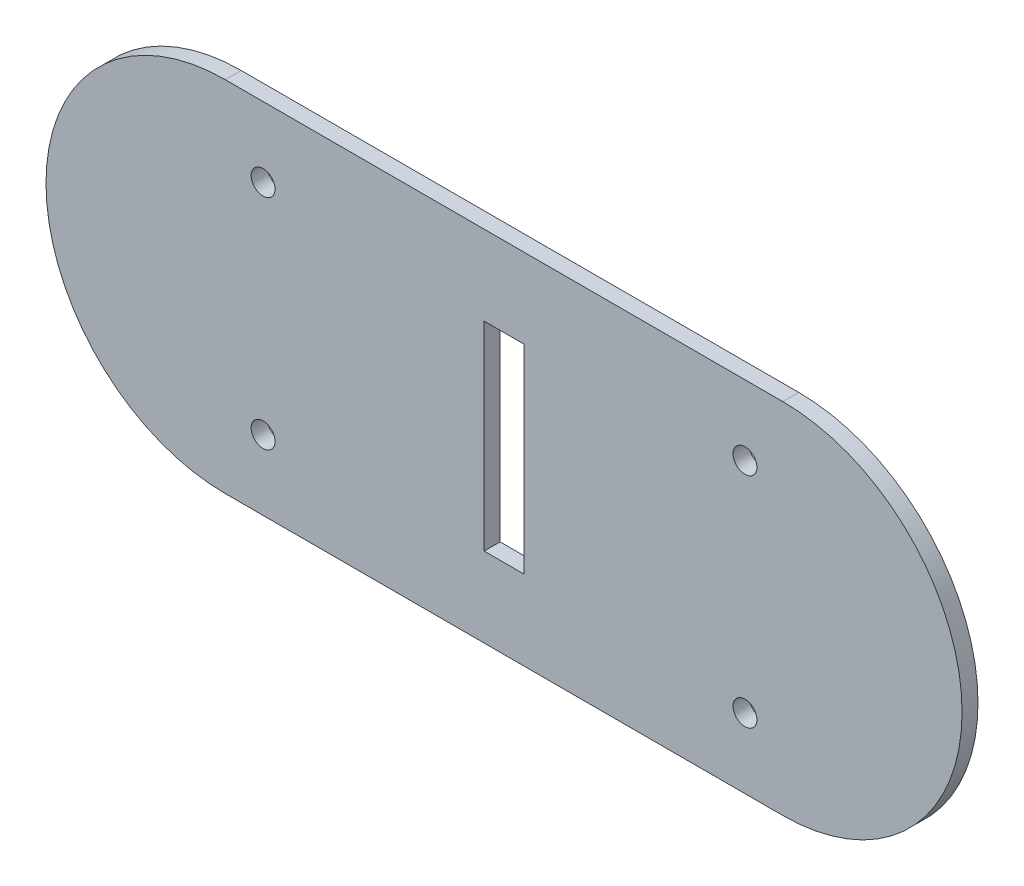
ISO-10303-21;
HEADER;
FILE_DESCRIPTION(('STEP AP214'),'2;1');
FILE_NAME('part.step','',(''),(''),'','','');
FILE_SCHEMA(('AUTOMOTIVE_DESIGN { 1 0 10303 214 1 1 1 1 }'));
ENDSEC;
DATA;
#1=APPLICATION_CONTEXT('core data for automotive mechanical design processes');
#2=APPLICATION_PROTOCOL_DEFINITION('international standard','automotive_design',2000,#1);
#3=PRODUCT_CONTEXT('',#1,'mechanical');
#4=PRODUCT('Part','Part','',(#3));
#5=PRODUCT_RELATED_PRODUCT_CATEGORY('part','',(#4));
#6=PRODUCT_DEFINITION_FORMATION('','',#4);
#7=PRODUCT_DEFINITION_CONTEXT('part definition',#1,'design');
#8=PRODUCT_DEFINITION('design','',#6,#7);
#9=PRODUCT_DEFINITION_SHAPE('','',#8);
#10=(LENGTH_UNIT() NAMED_UNIT(*) SI_UNIT(.MILLI.,.METRE.));
#11=(NAMED_UNIT(*) PLANE_ANGLE_UNIT() SI_UNIT($,.RADIAN.));
#12=(NAMED_UNIT(*) SI_UNIT($,.STERADIAN.) SOLID_ANGLE_UNIT());
#13=UNCERTAINTY_MEASURE_WITH_UNIT(LENGTH_MEASURE(1.E-05),#10,'distance_accuracy_value','');
#14=(GEOMETRIC_REPRESENTATION_CONTEXT(3) GLOBAL_UNCERTAINTY_ASSIGNED_CONTEXT((#13)) GLOBAL_UNIT_ASSIGNED_CONTEXT((#10,
#11,#12)) REPRESENTATION_CONTEXT('',''));
#15=CARTESIAN_POINT('',(0.,0.,0.));
#16=DIRECTION('',(0.,0.,1.));
#17=DIRECTION('',(1.,0.,0.));
#18=AXIS2_PLACEMENT_3D('',#15,#16,#17);
#19=CARTESIAN_POINT('',(90.1646015852963,212.057553234732,-190.475370577193));
#20=DIRECTION('',(0.,0.,1.));
#21=DIRECTION('',(-1.,0.,0.));
#22=AXIS2_PLACEMENT_3D('',#19,#20,#21);
#23=CYLINDRICAL_SURFACE('',#22,22.5);
#24=CARTESIAN_POINT('',(90.1646015852963,212.057553234732,-188.475370577193));
#25=DIRECTION('',(0.,0.,1.));
#26=DIRECTION('',(1.,0.,0.));
#27=AXIS2_PLACEMENT_3D('',#24,#25,#26);
#28=CIRCLE('',#27,22.5);
#29=CARTESIAN_POINT('',(90.1646015852963,189.557553234732,-188.475370577193));
#30=VERTEX_POINT('',#29);
#31=CARTESIAN_POINT('',(90.1646015852963,234.557553234732,-188.475370577193));
#32=VERTEX_POINT('',#31);
#33=EDGE_CURVE('E150',#30,#32,#28,.T.);
#34=ORIENTED_EDGE('',*,*,#33,.F.);
#35=DIRECTION('',(0.,0.,1.));
#36=VECTOR('',#35,1.);
#37=CARTESIAN_POINT('',(90.1646015852963,189.557553234732,-190.475370577193));
#38=LINE('',#37,#36);
#39=CARTESIAN_POINT('',(90.1646015852963,189.557553234732,-190.475370577193));
#40=VERTEX_POINT('',#39);
#41=EDGE_CURVE('E165',#40,#30,#38,.T.);
#42=ORIENTED_EDGE('',*,*,#41,.F.);
#43=CARTESIAN_POINT('',(90.1646015852963,212.057553234732,-190.475370577193));
#44=DIRECTION('',(0.,0.,1.));
#45=DIRECTION('',(1.,0.,0.));
#46=AXIS2_PLACEMENT_3D('',#43,#44,#45);
#47=CIRCLE('',#46,22.5);
#48=CARTESIAN_POINT('',(90.1646015852963,234.557553234732,-190.475370577193));
#49=VERTEX_POINT('',#48);
#50=EDGE_CURVE('E153',#40,#49,#47,.T.);
#51=ORIENTED_EDGE('',*,*,#50,.T.);
#52=DIRECTION('',(0.,0.,1.));
#53=VECTOR('',#52,1.);
#54=CARTESIAN_POINT('',(90.1646015852963,234.557553234732,-190.475370577193));
#55=LINE('',#54,#53);
#56=EDGE_CURVE('E183',#49,#32,#55,.T.);
#57=ORIENTED_EDGE('',*,*,#56,.T.);
#58=EDGE_LOOP('',(#34,#42,#51,#57));
#59=FACE_BOUND('',#58,.T.);
#60=ADVANCED_FACE('F37',(#59),#23,.T.);
#61=CARTESIAN_POINT('',(90.1646015852963,234.557553234732,-190.475370577193));
#62=DIRECTION('',(0.,-1.,0.));
#63=DIRECTION('',(0.,0.,1.));
#64=AXIS2_PLACEMENT_3D('',#61,#62,#63);
#65=PLANE('',#64);
#66=DIRECTION('',(-1.,0.,0.));
#67=VECTOR('',#66,1.);
#68=CARTESIAN_POINT('',(90.1646015852963,234.557553234732,-188.475370577193));
#69=LINE('',#68,#67);
#70=CARTESIAN_POINT('',(20.1646015852963,234.557553234732,-188.475370577193));
#71=VERTEX_POINT('',#70);
#72=EDGE_CURVE('E168',#32,#71,#69,.T.);
#73=ORIENTED_EDGE('',*,*,#72,.F.);
#74=ORIENTED_EDGE('',*,*,#56,.F.);
#75=DIRECTION('',(-1.,0.,0.));
#76=VECTOR('',#75,1.);
#77=CARTESIAN_POINT('',(90.1646015852963,234.557553234732,-190.475370577193));
#78=LINE('',#77,#76);
#79=CARTESIAN_POINT('',(20.1646015852963,234.557553234732,-190.475370577193));
#80=VERTEX_POINT('',#79);
#81=EDGE_CURVE('E156',#49,#80,#78,.T.);
#82=ORIENTED_EDGE('',*,*,#81,.T.);
#83=DIRECTION('',(0.,0.,1.));
#84=VECTOR('',#83,1.);
#85=CARTESIAN_POINT('',(20.1646015852963,234.557553234732,-190.475370577193));
#86=LINE('',#85,#84);
#87=EDGE_CURVE('E180',#80,#71,#86,.T.);
#88=ORIENTED_EDGE('',*,*,#87,.T.);
#89=EDGE_LOOP('',(#73,#74,#82,#88));
#90=FACE_BOUND('',#89,.T.);
#91=ADVANCED_FACE('F211',(#90),#65,.F.);
#92=CARTESIAN_POINT('',(20.1646015852963,212.057553234732,-190.475370577193));
#93=DIRECTION('',(0.,0.,1.));
#94=DIRECTION('',(-1.,0.,0.));
#95=AXIS2_PLACEMENT_3D('',#92,#93,#94);
#96=CYLINDRICAL_SURFACE('',#95,22.5);
#97=CARTESIAN_POINT('',(20.1646015852963,212.057553234732,-188.475370577193));
#98=DIRECTION('',(0.,0.,1.));
#99=DIRECTION('',(1.,0.,0.));
#100=AXIS2_PLACEMENT_3D('',#97,#98,#99);
#101=CIRCLE('',#100,22.5);
#102=CARTESIAN_POINT('',(20.1646015852963,189.557553234732,-188.475370577193));
#103=VERTEX_POINT('',#102);
#104=EDGE_CURVE('E171',#71,#103,#101,.T.);
#105=ORIENTED_EDGE('',*,*,#104,.F.);
#106=ORIENTED_EDGE('',*,*,#87,.F.);
#107=CARTESIAN_POINT('',(20.1646015852963,212.057553234732,-190.475370577193));
#108=DIRECTION('',(0.,0.,1.));
#109=DIRECTION('',(1.,0.,0.));
#110=AXIS2_PLACEMENT_3D('',#107,#108,#109);
#111=CIRCLE('',#110,22.5);
#112=CARTESIAN_POINT('',(20.1646015852963,189.557553234732,-190.475370577193));
#113=VERTEX_POINT('',#112);
#114=EDGE_CURVE('E160',#80,#113,#111,.T.);
#115=ORIENTED_EDGE('',*,*,#114,.T.);
#116=DIRECTION('',(0.,0.,1.));
#117=VECTOR('',#116,1.);
#118=CARTESIAN_POINT('',(20.1646015852963,189.557553234732,-190.475370577193));
#119=LINE('',#118,#117);
#120=EDGE_CURVE('E177',#113,#103,#119,.T.);
#121=ORIENTED_EDGE('',*,*,#120,.T.);
#122=EDGE_LOOP('',(#105,#106,#115,#121));
#123=FACE_BOUND('',#122,.T.);
#124=ADVANCED_FACE('F216',(#123),#96,.T.);
#125=CARTESIAN_POINT('',(90.1646015852963,189.557553234732,-190.475370577193));
#126=DIRECTION('',(0.,1.,0.));
#127=DIRECTION('',(0.,0.,-1.));
#128=AXIS2_PLACEMENT_3D('',#125,#126,#127);
#129=PLANE('',#128);
#130=DIRECTION('',(1.,0.,0.));
#131=VECTOR('',#130,1.);
#132=CARTESIAN_POINT('',(90.1646015852963,189.557553234732,-188.475370577193));
#133=LINE('',#132,#131);
#134=EDGE_CURVE('E157',#103,#30,#133,.T.);
#135=ORIENTED_EDGE('',*,*,#134,.F.);
#136=ORIENTED_EDGE('',*,*,#120,.F.);
#137=DIRECTION('',(1.,0.,0.));
#138=VECTOR('',#137,1.);
#139=CARTESIAN_POINT('',(90.1646015852963,189.557553234732,-190.475370577193));
#140=LINE('',#139,#138);
#141=EDGE_CURVE('E163',#113,#40,#140,.T.);
#142=ORIENTED_EDGE('',*,*,#141,.T.);
#143=ORIENTED_EDGE('',*,*,#41,.T.);
#144=EDGE_LOOP('',(#135,#136,#142,#143));
#145=FACE_BOUND('',#144,.T.);
#146=ADVANCED_FACE('F224',(#145),#129,.F.);
#147=CARTESIAN_POINT('',(90.1646015852963,212.057553234732,-190.475370577193));
#148=DIRECTION('',(0.,0.,-1.));
#149=DIRECTION('',(1.,0.,0.));
#150=AXIS2_PLACEMENT_3D('',#147,#148,#149);
#151=PLANE('',#150);
#152=DIRECTION('',(0.,-1.,0.));
#153=VECTOR('',#152,1.);
#154=CARTESIAN_POINT('',(52.6646015852963,224.557553234732,-190.475370577193));
#155=LINE('',#154,#153);
#156=CARTESIAN_POINT('',(52.6646015852963,224.557553234732,-190.475370577193));
#157=VERTEX_POINT('',#156);
#158=CARTESIAN_POINT('',(52.6646015852963,199.557553234732,-190.475370577193));
#159=VERTEX_POINT('',#158);
#160=EDGE_CURVE('E119',#157,#159,#155,.T.);
#161=ORIENTED_EDGE('',*,*,#160,.T.);
#162=DIRECTION('',(1.,0.,0.));
#163=VECTOR('',#162,1.);
#164=CARTESIAN_POINT('',(52.6646015852963,199.557553234732,-190.475370577193));
#165=LINE('',#164,#163);
#166=CARTESIAN_POINT('',(57.6646015852963,199.557553234732,-190.475370577193));
#167=VERTEX_POINT('',#166);
#168=EDGE_CURVE('E102',#159,#167,#165,.T.);
#169=ORIENTED_EDGE('',*,*,#168,.T.);
#170=DIRECTION('',(0.,1.,0.));
#171=VECTOR('',#170,1.);
#172=CARTESIAN_POINT('',(57.6646015852963,224.557553234732,-190.475370577193));
#173=LINE('',#172,#171);
#174=CARTESIAN_POINT('',(57.6646015852963,224.557553234732,-190.475370577193));
#175=VERTEX_POINT('',#174);
#176=EDGE_CURVE('E110',#167,#175,#173,.T.);
#177=ORIENTED_EDGE('',*,*,#176,.T.);
#178=DIRECTION('',(-1.,0.,0.));
#179=VECTOR('',#178,1.);
#180=CARTESIAN_POINT('',(52.6646015852963,224.557553234732,-190.475370577193));
#181=LINE('',#180,#179);
#182=EDGE_CURVE('E115',#175,#157,#181,.T.);
#183=ORIENTED_EDGE('',*,*,#182,.T.);
#184=EDGE_LOOP('',(#161,#169,#177,#183));
#185=FACE_BOUND('',#184,.T.);
#186=CARTESIAN_POINT('',(85.4115481479809,198.337800112773,-190.475370577193));
#187=DIRECTION('',(0.,0.,1.));
#188=DIRECTION('',(-1.,0.,0.));
#189=AXIS2_PLACEMENT_3D('',#186,#187,#188);
#190=CIRCLE('',#189,1.5);
#191=CARTESIAN_POINT('',(83.9115481479809,198.337800112773,-190.475370577193));
#192=VERTEX_POINT('',#191);
#193=EDGE_CURVE('E126',#192,#192,#190,.T.);
#194=ORIENTED_EDGE('',*,*,#193,.T.);
#195=EDGE_LOOP('',(#194));
#196=FACE_BOUND('',#195,.T.);
#197=CARTESIAN_POINT('',(24.9176550226118,198.337800112773,-190.475370577193));
#198=DIRECTION('',(0.,0.,1.));
#199=DIRECTION('',(1.,0.,0.));
#200=AXIS2_PLACEMENT_3D('',#197,#198,#199);
#201=CIRCLE('',#200,1.5);
#202=CARTESIAN_POINT('',(26.4176550226118,198.337800112773,-190.475370577193));
#203=VERTEX_POINT('',#202);
#204=EDGE_CURVE('E139',#203,#203,#201,.T.);
#205=ORIENTED_EDGE('',*,*,#204,.T.);
#206=EDGE_LOOP('',(#205));
#207=FACE_BOUND('',#206,.T.);
#208=CARTESIAN_POINT('',(24.9176550226117,225.77730635669,-190.475370577193));
#209=DIRECTION('',(0.,0.,1.));
#210=DIRECTION('',(-1.,0.,0.));
#211=AXIS2_PLACEMENT_3D('',#208,#209,#210);
#212=CIRCLE('',#211,1.5);
#213=CARTESIAN_POINT('',(23.4176550226117,225.77730635669,-190.475370577193));
#214=VERTEX_POINT('',#213);
#215=EDGE_CURVE('E133',#214,#214,#212,.T.);
#216=ORIENTED_EDGE('',*,*,#215,.T.);
#217=EDGE_LOOP('',(#216));
#218=FACE_BOUND('',#217,.T.);
#219=CARTESIAN_POINT('',(85.4115481479809,225.77730635669,-190.475370577193));
#220=DIRECTION('',(0.,0.,1.));
#221=DIRECTION('',(1.,0.,0.));
#222=AXIS2_PLACEMENT_3D('',#219,#220,#221);
#223=CIRCLE('',#222,1.5);
#224=CARTESIAN_POINT('',(86.9115481479809,225.77730635669,-190.475370577193));
#225=VERTEX_POINT('',#224);
#226=EDGE_CURVE('E132',#225,#225,#223,.T.);
#227=ORIENTED_EDGE('',*,*,#226,.T.);
#228=EDGE_LOOP('',(#227));
#229=FACE_BOUND('',#228,.T.);
#230=ORIENTED_EDGE('',*,*,#50,.F.);
#231=ORIENTED_EDGE('',*,*,#141,.F.);
#232=ORIENTED_EDGE('',*,*,#114,.F.);
#233=ORIENTED_EDGE('',*,*,#81,.F.);
#234=EDGE_LOOP('',(#230,#231,#232,#233));
#235=FACE_BOUND('',#234,.T.);
#236=ADVANCED_FACE('F117',(#185,#196,#207,#218,#229,#235),#151,.T.);
#237=CARTESIAN_POINT('',(90.1646015852963,212.057553234732,-188.475370577193));
#238=DIRECTION('',(0.,0.,-1.));
#239=DIRECTION('',(1.,0.,0.));
#240=AXIS2_PLACEMENT_3D('',#237,#238,#239);
#241=PLANE('',#240);
#242=DIRECTION('',(-1.,0.,0.));
#243=VECTOR('',#242,1.);
#244=CARTESIAN_POINT('',(90.1646015852963,224.557553234732,-188.475370577193));
#245=LINE('',#244,#243);
#246=CARTESIAN_POINT('',(57.6646015852963,224.557553234732,-188.475370577193));
#247=VERTEX_POINT('',#246);
#248=CARTESIAN_POINT('',(52.6646015852963,224.557553234732,-188.475370577193));
#249=VERTEX_POINT('',#248);
#250=EDGE_CURVE('E44',#247,#249,#245,.T.);
#251=ORIENTED_EDGE('',*,*,#250,.F.);
#252=DIRECTION('',(0.,1.,0.));
#253=VECTOR('',#252,1.);
#254=CARTESIAN_POINT('',(57.6646015852963,212.057553234732,-188.475370577193));
#255=LINE('',#254,#253);
#256=CARTESIAN_POINT('',(57.6646015852963,199.557553234732,-188.475370577193));
#257=VERTEX_POINT('',#256);
#258=EDGE_CURVE('E187',#257,#247,#255,.T.);
#259=ORIENTED_EDGE('',*,*,#258,.F.);
#260=DIRECTION('',(1.,0.,0.));
#261=VECTOR('',#260,1.);
#262=CARTESIAN_POINT('',(90.1646015852963,199.557553234732,-188.475370577193));
#263=LINE('',#262,#261);
#264=CARTESIAN_POINT('',(52.6646015852963,199.557553234732,-188.475370577193));
#265=VERTEX_POINT('',#264);
#266=EDGE_CURVE('E105',#265,#257,#263,.T.);
#267=ORIENTED_EDGE('',*,*,#266,.F.);
#268=DIRECTION('',(0.,-1.,0.));
#269=VECTOR('',#268,1.);
#270=CARTESIAN_POINT('',(52.6646015852963,212.057553234732,-188.475370577193));
#271=LINE('',#270,#269);
#272=EDGE_CURVE('E11',#249,#265,#271,.T.);
#273=ORIENTED_EDGE('',*,*,#272,.F.);
#274=EDGE_LOOP('',(#251,#259,#267,#273));
#275=FACE_BOUND('',#274,.T.);
#276=CARTESIAN_POINT('',(85.4115481479809,198.337800112773,-188.475370577193));
#277=DIRECTION('',(0.,0.,1.));
#278=DIRECTION('',(-1.,0.,0.));
#279=AXIS2_PLACEMENT_3D('',#276,#277,#278);
#280=CIRCLE('',#279,1.5);
#281=CARTESIAN_POINT('',(83.9115481479809,198.337800112773,-188.475370577193));
#282=VERTEX_POINT('',#281);
#283=EDGE_CURVE('E142',#282,#282,#280,.T.);
#284=ORIENTED_EDGE('',*,*,#283,.F.);
#285=EDGE_LOOP('',(#284));
#286=FACE_BOUND('',#285,.T.);
#287=CARTESIAN_POINT('',(24.9176550226118,198.337800112773,-188.475370577193));
#288=DIRECTION('',(0.,0.,1.));
#289=DIRECTION('',(1.,0.,0.));
#290=AXIS2_PLACEMENT_3D('',#287,#288,#289);
#291=CIRCLE('',#290,1.5);
#292=CARTESIAN_POINT('',(26.4176550226118,198.337800112773,-188.475370577193));
#293=VERTEX_POINT('',#292);
#294=EDGE_CURVE('E136',#293,#293,#291,.T.);
#295=ORIENTED_EDGE('',*,*,#294,.F.);
#296=EDGE_LOOP('',(#295));
#297=FACE_BOUND('',#296,.T.);
#298=CARTESIAN_POINT('',(24.9176550226117,225.77730635669,-188.475370577193));
#299=DIRECTION('',(0.,0.,1.));
#300=DIRECTION('',(-1.,0.,0.));
#301=AXIS2_PLACEMENT_3D('',#298,#299,#300);
#302=CIRCLE('',#301,1.5);
#303=CARTESIAN_POINT('',(23.4176550226117,225.77730635669,-188.475370577193));
#304=VERTEX_POINT('',#303);
#305=EDGE_CURVE('E129',#304,#304,#302,.T.);
#306=ORIENTED_EDGE('',*,*,#305,.F.);
#307=EDGE_LOOP('',(#306));
#308=FACE_BOUND('',#307,.T.);
#309=CARTESIAN_POINT('',(85.4115481479809,225.77730635669,-188.475370577193));
#310=DIRECTION('',(0.,0.,1.));
#311=DIRECTION('',(1.,0.,0.));
#312=AXIS2_PLACEMENT_3D('',#309,#310,#311);
#313=CIRCLE('',#312,1.5);
#314=CARTESIAN_POINT('',(86.9115481479809,225.77730635669,-188.475370577193));
#315=VERTEX_POINT('',#314);
#316=EDGE_CURVE('E147',#315,#315,#313,.T.);
#317=ORIENTED_EDGE('',*,*,#316,.F.);
#318=EDGE_LOOP('',(#317));
#319=FACE_BOUND('',#318,.T.);
#320=ORIENTED_EDGE('',*,*,#33,.T.);
#321=ORIENTED_EDGE('',*,*,#72,.T.);
#322=ORIENTED_EDGE('',*,*,#104,.T.);
#323=ORIENTED_EDGE('',*,*,#134,.T.);
#324=EDGE_LOOP('',(#320,#321,#322,#323));
#325=FACE_BOUND('',#324,.T.);
#326=ADVANCED_FACE('F194',(#275,#286,#297,#308,#319,#325),#241,.F.);
#327=CARTESIAN_POINT('',(85.4115481479809,225.77730635669,-188.475370577193));
#328=DIRECTION('',(0.,0.,-1.));
#329=DIRECTION('',(1.,0.,0.));
#330=AXIS2_PLACEMENT_3D('',#327,#328,#329);
#331=CYLINDRICAL_SURFACE('',#330,1.5);
#332=ORIENTED_EDGE('',*,*,#316,.T.);
#333=EDGE_LOOP('',(#332));
#334=FACE_BOUND('',#333,.T.);
#335=ORIENTED_EDGE('',*,*,#226,.F.);
#336=EDGE_LOOP('',(#335));
#337=FACE_BOUND('',#336,.T.);
#338=ADVANCED_FACE('F238',(#334,#337),#331,.F.);
#339=CARTESIAN_POINT('',(24.9176550226117,225.77730635669,-188.475370577193));
#340=DIRECTION('',(0.,0.,-1.));
#341=DIRECTION('',(1.,0.,0.));
#342=AXIS2_PLACEMENT_3D('',#339,#340,#341);
#343=CYLINDRICAL_SURFACE('',#342,1.5);
#344=ORIENTED_EDGE('',*,*,#305,.T.);
#345=EDGE_LOOP('',(#344));
#346=FACE_BOUND('',#345,.T.);
#347=ORIENTED_EDGE('',*,*,#215,.F.);
#348=EDGE_LOOP('',(#347));
#349=FACE_BOUND('',#348,.T.);
#350=ADVANCED_FACE('F242',(#346,#349),#343,.F.);
#351=CARTESIAN_POINT('',(24.9176550226118,198.337800112773,-188.475370577193));
#352=DIRECTION('',(0.,0.,-1.));
#353=DIRECTION('',(1.,0.,0.));
#354=AXIS2_PLACEMENT_3D('',#351,#352,#353);
#355=CYLINDRICAL_SURFACE('',#354,1.5);
#356=ORIENTED_EDGE('',*,*,#294,.T.);
#357=EDGE_LOOP('',(#356));
#358=FACE_BOUND('',#357,.T.);
#359=ORIENTED_EDGE('',*,*,#204,.F.);
#360=EDGE_LOOP('',(#359));
#361=FACE_BOUND('',#360,.T.);
#362=ADVANCED_FACE('F205',(#358,#361),#355,.F.);
#363=CARTESIAN_POINT('',(85.4115481479809,198.337800112773,-188.475370577193));
#364=DIRECTION('',(0.,0.,-1.));
#365=DIRECTION('',(1.,0.,0.));
#366=AXIS2_PLACEMENT_3D('',#363,#364,#365);
#367=CYLINDRICAL_SURFACE('',#366,1.5);
#368=ORIENTED_EDGE('',*,*,#283,.T.);
#369=EDGE_LOOP('',(#368));
#370=FACE_BOUND('',#369,.T.);
#371=ORIENTED_EDGE('',*,*,#193,.F.);
#372=EDGE_LOOP('',(#371));
#373=FACE_BOUND('',#372,.T.);
#374=ADVANCED_FACE('F198',(#370,#373),#367,.F.);
#375=CARTESIAN_POINT('',(52.6646015852963,224.557553234732,-180.475370577193));
#376=DIRECTION('',(-1.,0.,0.));
#377=DIRECTION('',(0.,0.,-1.));
#378=AXIS2_PLACEMENT_3D('',#375,#376,#377);
#379=PLANE('',#378);
#380=DIRECTION('',(0.,0.,-1.));
#381=VECTOR('',#380,1.);
#382=CARTESIAN_POINT('',(52.6646015852963,224.557553234732,-180.475370577193));
#383=LINE('',#382,#381);
#384=EDGE_CURVE('E124',#249,#157,#383,.T.);
#385=ORIENTED_EDGE('',*,*,#384,.F.);
#386=ORIENTED_EDGE('',*,*,#272,.T.);
#387=DIRECTION('',(0.,0.,-1.));
#388=VECTOR('',#387,1.);
#389=CARTESIAN_POINT('',(52.6646015852963,199.557553234732,-180.475370577193));
#390=LINE('',#389,#388);
#391=EDGE_CURVE('E50',#265,#159,#390,.T.);
#392=ORIENTED_EDGE('',*,*,#391,.T.);
#393=ORIENTED_EDGE('',*,*,#160,.F.);
#394=EDGE_LOOP('',(#385,#386,#392,#393));
#395=FACE_BOUND('',#394,.T.);
#396=ADVANCED_FACE('F196',(#395),#379,.F.);
#397=CARTESIAN_POINT('',(52.6646015852963,224.557553234732,-180.475370577193));
#398=DIRECTION('',(0.,1.,0.));
#399=DIRECTION('',(0.,0.,-1.));
#400=AXIS2_PLACEMENT_3D('',#397,#398,#399);
#401=PLANE('',#400);
#402=DIRECTION('',(0.,0.,-1.));
#403=VECTOR('',#402,1.);
#404=CARTESIAN_POINT('',(57.6646015852963,224.557553234732,-180.475370577193));
#405=LINE('',#404,#403);
#406=EDGE_CURVE('E107',#247,#175,#405,.T.);
#407=ORIENTED_EDGE('',*,*,#406,.F.);
#408=ORIENTED_EDGE('',*,*,#250,.T.);
#409=ORIENTED_EDGE('',*,*,#384,.T.);
#410=ORIENTED_EDGE('',*,*,#182,.F.);
#411=EDGE_LOOP('',(#407,#408,#409,#410));
#412=FACE_BOUND('',#411,.T.);
#413=ADVANCED_FACE('F191',(#412),#401,.F.);
#414=CARTESIAN_POINT('',(57.6646015852963,224.557553234732,-180.475370577193));
#415=DIRECTION('',(1.,0.,0.));
#416=DIRECTION('',(0.,1.,0.));
#417=AXIS2_PLACEMENT_3D('',#414,#415,#416);
#418=PLANE('',#417);
#419=DIRECTION('',(0.,0.,-1.));
#420=VECTOR('',#419,1.);
#421=CARTESIAN_POINT('',(57.6646015852963,199.557553234732,-180.475370577193));
#422=LINE('',#421,#420);
#423=EDGE_CURVE('E58',#257,#167,#422,.T.);
#424=ORIENTED_EDGE('',*,*,#423,.F.);
#425=ORIENTED_EDGE('',*,*,#258,.T.);
#426=ORIENTED_EDGE('',*,*,#406,.T.);
#427=ORIENTED_EDGE('',*,*,#176,.F.);
#428=EDGE_LOOP('',(#424,#425,#426,#427));
#429=FACE_BOUND('',#428,.T.);
#430=ADVANCED_FACE('F111',(#429),#418,.F.);
#431=CARTESIAN_POINT('',(52.6646015852963,199.557553234732,-180.475370577193));
#432=DIRECTION('',(0.,-1.,0.));
#433=DIRECTION('',(0.,0.,1.));
#434=AXIS2_PLACEMENT_3D('',#431,#432,#433);
#435=PLANE('',#434);
#436=ORIENTED_EDGE('',*,*,#391,.F.);
#437=ORIENTED_EDGE('',*,*,#266,.T.);
#438=ORIENTED_EDGE('',*,*,#423,.T.);
#439=ORIENTED_EDGE('',*,*,#168,.F.);
#440=EDGE_LOOP('',(#436,#437,#438,#439));
#441=FACE_BOUND('',#440,.T.);
#442=ADVANCED_FACE('F100',(#441),#435,.F.);
#443=CLOSED_SHELL('',(#60,#91,#124,#146,#236,#326,#338,#350,#362,#374,#396,#413,#430,#442));
#444=MANIFOLD_SOLID_BREP('B2',#443);
#445=ADVANCED_BREP_SHAPE_REPRESENTATION('',(#18,#444),#14);
#446=SHAPE_DEFINITION_REPRESENTATION(#9,#445);
ENDSEC;
END-ISO-10303-21;
